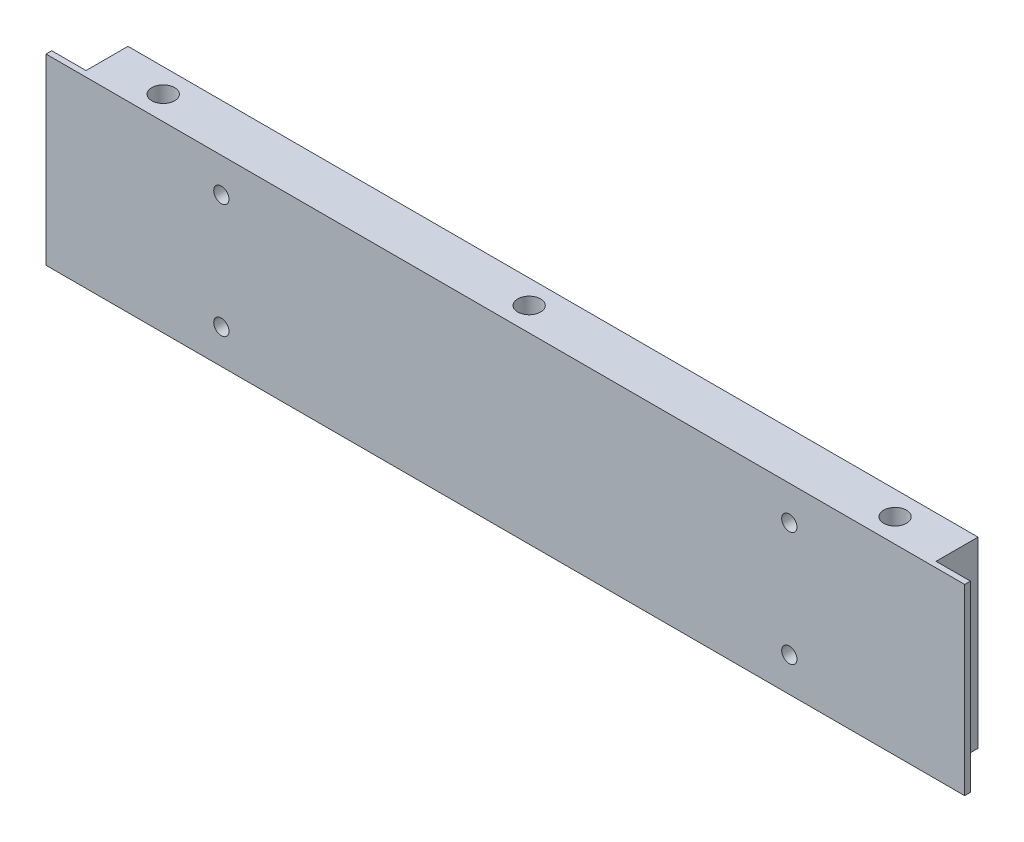
ISO-10303-21;
HEADER;
FILE_DESCRIPTION(('STEP AP214'),'2;1');
FILE_NAME('part.step','',(''),(''),'','','');
FILE_SCHEMA(('AUTOMOTIVE_DESIGN { 1 0 10303 214 1 1 1 1 }'));
ENDSEC;
DATA;
#1=APPLICATION_CONTEXT('core data for automotive mechanical design processes');
#2=APPLICATION_PROTOCOL_DEFINITION('international standard','automotive_design',2000,#1);
#3=PRODUCT_CONTEXT('',#1,'mechanical');
#4=PRODUCT('Part','Part','',(#3));
#5=PRODUCT_RELATED_PRODUCT_CATEGORY('part','',(#4));
#6=PRODUCT_DEFINITION_FORMATION('','',#4);
#7=PRODUCT_DEFINITION_CONTEXT('part definition',#1,'design');
#8=PRODUCT_DEFINITION('design','',#6,#7);
#9=PRODUCT_DEFINITION_SHAPE('','',#8);
#10=(LENGTH_UNIT() NAMED_UNIT(*) SI_UNIT(.MILLI.,.METRE.));
#11=(NAMED_UNIT(*) PLANE_ANGLE_UNIT() SI_UNIT($,.RADIAN.));
#12=(NAMED_UNIT(*) SI_UNIT($,.STERADIAN.) SOLID_ANGLE_UNIT());
#13=UNCERTAINTY_MEASURE_WITH_UNIT(LENGTH_MEASURE(1.E-05),#10,'distance_accuracy_value','');
#14=(GEOMETRIC_REPRESENTATION_CONTEXT(3) GLOBAL_UNCERTAINTY_ASSIGNED_CONTEXT((#13)) GLOBAL_UNIT_ASSIGNED_CONTEXT((#10,
#11,#12)) REPRESENTATION_CONTEXT('',''));
#15=CARTESIAN_POINT('',(0.,0.,0.));
#16=DIRECTION('',(0.,0.,1.));
#17=DIRECTION('',(1.,0.,0.));
#18=AXIS2_PLACEMENT_3D('',#15,#16,#17);
#19=CARTESIAN_POINT('',(0.,-48.,12.5));
#20=DIRECTION('',(0.,0.,1.));
#21=DIRECTION('',(1.,0.,0.));
#22=AXIS2_PLACEMENT_3D('',#19,#20,#21);
#23=PLANE('',#22);
#24=CARTESIAN_POINT('',(46.,-8.99999999999999,12.5));
#25=DIRECTION('',(0.,0.,1.));
#26=DIRECTION('',(1.,0.,0.));
#27=AXIS2_PLACEMENT_3D('',#24,#25,#26);
#28=CIRCLE('',#27,2.);
#29=CARTESIAN_POINT('',(48.,-8.99999999999999,12.5));
#30=VERTEX_POINT('',#29);
#31=EDGE_CURVE('E172',#30,#30,#28,.T.);
#32=ORIENTED_EDGE('',*,*,#31,.F.);
#33=EDGE_LOOP('',(#32));
#34=FACE_BOUND('',#33,.T.);
#35=CARTESIAN_POINT('',(195.,-39.,12.5));
#36=DIRECTION('',(0.,0.,1.));
#37=DIRECTION('',(-1.,0.,0.));
#38=AXIS2_PLACEMENT_3D('',#35,#36,#37);
#39=CIRCLE('',#38,2.00000000000002);
#40=CARTESIAN_POINT('',(193.,-39.,12.5));
#41=VERTEX_POINT('',#40);
#42=EDGE_CURVE('E121',#41,#41,#39,.T.);
#43=ORIENTED_EDGE('',*,*,#42,.F.);
#44=EDGE_LOOP('',(#43));
#45=FACE_BOUND('',#44,.T.);
#46=DIRECTION('',(0.,-1.,0.));
#47=VECTOR('',#46,1.);
#48=CARTESIAN_POINT('',(0.,0.,12.5));
#49=LINE('',#48,#47);
#50=CARTESIAN_POINT('',(0.,0.,12.5));
#51=VERTEX_POINT('',#50);
#52=CARTESIAN_POINT('',(0.,-48.,12.5));
#53=VERTEX_POINT('',#52);
#54=EDGE_CURVE('E123',#51,#53,#49,.T.);
#55=ORIENTED_EDGE('',*,*,#54,.T.);
#56=DIRECTION('',(1.,0.,0.));
#57=VECTOR('',#56,1.);
#58=CARTESIAN_POINT('',(0.,-48.,12.5));
#59=LINE('',#58,#57);
#60=CARTESIAN_POINT('',(241.,-48.,12.5));
#61=VERTEX_POINT('',#60);
#62=EDGE_CURVE('E147',#53,#61,#59,.T.);
#63=ORIENTED_EDGE('',*,*,#62,.T.);
#64=DIRECTION('',(0.,1.,0.));
#65=VECTOR('',#64,1.);
#66=CARTESIAN_POINT('',(241.,0.,12.5));
#67=LINE('',#66,#65);
#68=CARTESIAN_POINT('',(241.,0.,12.5));
#69=VERTEX_POINT('',#68);
#70=EDGE_CURVE('E145',#61,#69,#67,.T.);
#71=ORIENTED_EDGE('',*,*,#70,.T.);
#72=DIRECTION('',(-1.,0.,0.));
#73=VECTOR('',#72,1.);
#74=CARTESIAN_POINT('',(0.,0.,12.5));
#75=LINE('',#74,#73);
#76=EDGE_CURVE('E129',#69,#51,#75,.T.);
#77=ORIENTED_EDGE('',*,*,#76,.T.);
#78=EDGE_LOOP('',(#55,#63,#71,#77));
#79=FACE_BOUND('',#78,.T.);
#80=CARTESIAN_POINT('',(195.,-8.99999999999999,12.5));
#81=DIRECTION('',(0.,0.,1.));
#82=DIRECTION('',(-1.,0.,0.));
#83=AXIS2_PLACEMENT_3D('',#80,#81,#82);
#84=CIRCLE('',#83,2.00000000000002);
#85=CARTESIAN_POINT('',(193.,-8.99999999999999,12.5));
#86=VERTEX_POINT('',#85);
#87=EDGE_CURVE('E178',#86,#86,#84,.T.);
#88=ORIENTED_EDGE('',*,*,#87,.F.);
#89=EDGE_LOOP('',(#88));
#90=FACE_BOUND('',#89,.T.);
#91=CARTESIAN_POINT('',(46.,-39.,12.5));
#92=DIRECTION('',(0.,0.,1.));
#93=DIRECTION('',(1.,0.,0.));
#94=AXIS2_PLACEMENT_3D('',#91,#92,#93);
#95=CIRCLE('',#94,2.);
#96=CARTESIAN_POINT('',(48.,-39.,12.5));
#97=VERTEX_POINT('',#96);
#98=EDGE_CURVE('E166',#97,#97,#95,.T.);
#99=ORIENTED_EDGE('',*,*,#98,.F.);
#100=EDGE_LOOP('',(#99));
#101=FACE_BOUND('',#100,.T.);
#102=ADVANCED_FACE('F31',(#34,#45,#79,#90,#101),#23,.T.);
#103=CARTESIAN_POINT('',(0.,-48.,0.));
#104=DIRECTION('',(0.,0.,1.));
#105=DIRECTION('',(1.,0.,0.));
#106=AXIS2_PLACEMENT_3D('',#103,#104,#105);
#107=PLANE('',#106);
#108=CARTESIAN_POINT('',(46.,-8.99999999999999,0.));
#109=DIRECTION('',(0.,0.,1.));
#110=DIRECTION('',(1.,0.,0.));
#111=AXIS2_PLACEMENT_3D('',#108,#109,#110);
#112=CIRCLE('',#111,2.);
#113=CARTESIAN_POINT('',(48.,-8.99999999999999,0.));
#114=VERTEX_POINT('',#113);
#115=EDGE_CURVE('E169',#114,#114,#112,.T.);
#116=ORIENTED_EDGE('',*,*,#115,.T.);
#117=EDGE_LOOP('',(#116));
#118=FACE_BOUND('',#117,.T.);
#119=CARTESIAN_POINT('',(195.,-39.,0.));
#120=DIRECTION('',(0.,0.,1.));
#121=DIRECTION('',(-1.,0.,0.));
#122=AXIS2_PLACEMENT_3D('',#119,#120,#121);
#123=CIRCLE('',#122,2.00000000000002);
#124=CARTESIAN_POINT('',(193.,-39.,0.));
#125=VERTEX_POINT('',#124);
#126=EDGE_CURVE('E126',#125,#125,#123,.T.);
#127=ORIENTED_EDGE('',*,*,#126,.T.);
#128=EDGE_LOOP('',(#127));
#129=FACE_BOUND('',#128,.T.);
#130=DIRECTION('',(1.,0.,0.));
#131=VECTOR('',#130,1.);
#132=CARTESIAN_POINT('',(0.,-48.,0.));
#133=LINE('',#132,#131);
#134=CARTESIAN_POINT('',(9.00000000000001,-48.,0.));
#135=VERTEX_POINT('',#134);
#136=CARTESIAN_POINT('',(232.,-48.,0.));
#137=VERTEX_POINT('',#136);
#138=EDGE_CURVE('E115',#135,#137,#133,.T.);
#139=ORIENTED_EDGE('',*,*,#138,.F.);
#140=DIRECTION('',(0.,1.,0.));
#141=VECTOR('',#140,1.);
#142=CARTESIAN_POINT('',(9.00000000000001,-48.,0.));
#143=LINE('',#142,#141);
#144=CARTESIAN_POINT('',(9.00000000000001,0.,0.));
#145=VERTEX_POINT('',#144);
#146=EDGE_CURVE('E99',#135,#145,#143,.T.);
#147=ORIENTED_EDGE('',*,*,#146,.T.);
#148=DIRECTION('',(-1.,0.,0.));
#149=VECTOR('',#148,1.);
#150=CARTESIAN_POINT('',(0.,0.,0.));
#151=LINE('',#150,#149);
#152=CARTESIAN_POINT('',(232.,0.,0.));
#153=VERTEX_POINT('',#152);
#154=EDGE_CURVE('E120',#153,#145,#151,.T.);
#155=ORIENTED_EDGE('',*,*,#154,.F.);
#156=DIRECTION('',(0.,1.,0.));
#157=VECTOR('',#156,1.);
#158=CARTESIAN_POINT('',(232.,-48.,0.));
#159=LINE('',#158,#157);
#160=EDGE_CURVE('E54',#137,#153,#159,.T.);
#161=ORIENTED_EDGE('',*,*,#160,.F.);
#162=EDGE_LOOP('',(#139,#147,#155,#161));
#163=FACE_BOUND('',#162,.T.);
#164=CARTESIAN_POINT('',(195.,-8.99999999999999,0.));
#165=DIRECTION('',(0.,0.,1.));
#166=DIRECTION('',(-1.,0.,0.));
#167=AXIS2_PLACEMENT_3D('',#164,#165,#166);
#168=CIRCLE('',#167,2.00000000000002);
#169=CARTESIAN_POINT('',(193.,-8.99999999999999,0.));
#170=VERTEX_POINT('',#169);
#171=EDGE_CURVE('E175',#170,#170,#168,.T.);
#172=ORIENTED_EDGE('',*,*,#171,.T.);
#173=EDGE_LOOP('',(#172));
#174=FACE_BOUND('',#173,.T.);
#175=CARTESIAN_POINT('',(46.,-39.,0.));
#176=DIRECTION('',(0.,0.,1.));
#177=DIRECTION('',(1.,0.,0.));
#178=AXIS2_PLACEMENT_3D('',#175,#176,#177);
#179=CIRCLE('',#178,2.);
#180=CARTESIAN_POINT('',(48.,-39.,0.));
#181=VERTEX_POINT('',#180);
#182=EDGE_CURVE('E164',#181,#181,#179,.T.);
#183=ORIENTED_EDGE('',*,*,#182,.T.);
#184=EDGE_LOOP('',(#183));
#185=FACE_BOUND('',#184,.T.);
#186=ADVANCED_FACE('F118',(#118,#129,#163,#174,#185),#107,.F.);
#187=CARTESIAN_POINT('',(0.,0.,12.5));
#188=DIRECTION('',(1.,0.,0.));
#189=DIRECTION('',(0.,1.,0.));
#190=AXIS2_PLACEMENT_3D('',#187,#188,#189);
#191=PLANE('',#190);
#192=DIRECTION('',(0.,0.,-1.));
#193=VECTOR('',#192,1.);
#194=CARTESIAN_POINT('',(0.,0.,12.5));
#195=LINE('',#194,#193);
#196=CARTESIAN_POINT('',(0.,0.,11.));
#197=VERTEX_POINT('',#196);
#198=EDGE_CURVE('E132',#51,#197,#195,.T.);
#199=ORIENTED_EDGE('',*,*,#198,.T.);
#200=DIRECTION('',(0.,1.,0.));
#201=VECTOR('',#200,1.);
#202=CARTESIAN_POINT('',(0.,-48.,11.));
#203=LINE('',#202,#201);
#204=CARTESIAN_POINT('',(0.,-48.,11.));
#205=VERTEX_POINT('',#204);
#206=EDGE_CURVE('E46',#205,#197,#203,.T.);
#207=ORIENTED_EDGE('',*,*,#206,.F.);
#208=DIRECTION('',(0.,0.,-1.));
#209=VECTOR('',#208,1.);
#210=CARTESIAN_POINT('',(0.,-48.,12.5));
#211=LINE('',#210,#209);
#212=EDGE_CURVE('E11',#53,#205,#211,.T.);
#213=ORIENTED_EDGE('',*,*,#212,.F.);
#214=ORIENTED_EDGE('',*,*,#54,.F.);
#215=EDGE_LOOP('',(#199,#207,#213,#214));
#216=FACE_BOUND('',#215,.T.);
#217=ADVANCED_FACE('F33',(#216),#191,.F.);
#218=CARTESIAN_POINT('',(0.,-48.,12.5));
#219=DIRECTION('',(0.,1.,0.));
#220=DIRECTION('',(-1.,0.,0.));
#221=AXIS2_PLACEMENT_3D('',#218,#219,#220);
#222=PLANE('',#221);
#223=CARTESIAN_POINT('',(216.5,-48.,6.25000000000003));
#224=DIRECTION('',(0.,1.,0.));
#225=DIRECTION('',(-1.,0.,0.));
#226=AXIS2_PLACEMENT_3D('',#223,#224,#225);
#227=CIRCLE('',#226,3.00000000000002);
#228=CARTESIAN_POINT('',(213.5,-48.,6.25000000000003));
#229=VERTEX_POINT('',#228);
#230=EDGE_CURVE('E213',#229,#229,#227,.F.);
#231=ORIENTED_EDGE('',*,*,#230,.F.);
#232=EDGE_LOOP('',(#231));
#233=FACE_BOUND('',#232,.T.);
#234=CARTESIAN_POINT('',(24.5,-48.,6.25000000000003));
#235=DIRECTION('',(0.,1.,0.));
#236=DIRECTION('',(-1.,0.,0.));
#237=AXIS2_PLACEMENT_3D('',#234,#235,#236);
#238=CIRCLE('',#237,3.);
#239=CARTESIAN_POINT('',(21.5,-48.,6.25000000000003));
#240=VERTEX_POINT('',#239);
#241=EDGE_CURVE('E207',#240,#240,#238,.F.);
#242=ORIENTED_EDGE('',*,*,#241,.F.);
#243=EDGE_LOOP('',(#242));
#244=FACE_BOUND('',#243,.T.);
#245=CARTESIAN_POINT('',(120.5,-48.,6.25000000000003));
#246=DIRECTION('',(0.,1.,0.));
#247=DIRECTION('',(-1.,0.,0.));
#248=AXIS2_PLACEMENT_3D('',#245,#246,#247);
#249=CIRCLE('',#248,3.00000000000001);
#250=CARTESIAN_POINT('',(117.5,-48.,6.25000000000003));
#251=VERTEX_POINT('',#250);
#252=EDGE_CURVE('E200',#251,#251,#249,.F.);
#253=ORIENTED_EDGE('',*,*,#252,.F.);
#254=EDGE_LOOP('',(#253));
#255=FACE_BOUND('',#254,.T.);
#256=DIRECTION('',(1.,0.,0.));
#257=VECTOR('',#256,1.);
#258=CARTESIAN_POINT('',(9.,-48.,11.));
#259=LINE('',#258,#257);
#260=CARTESIAN_POINT('',(9.,-48.,11.));
#261=VERTEX_POINT('',#260);
#262=EDGE_CURVE('E110',#205,#261,#259,.T.);
#263=ORIENTED_EDGE('',*,*,#262,.T.);
#264=DIRECTION('',(0.,0.,-1.));
#265=VECTOR('',#264,1.);
#266=CARTESIAN_POINT('',(9.00000000000001,-48.,0.));
#267=LINE('',#266,#265);
#268=EDGE_CURVE('E102',#261,#135,#267,.T.);
#269=ORIENTED_EDGE('',*,*,#268,.T.);
#270=ORIENTED_EDGE('',*,*,#138,.T.);
#271=DIRECTION('',(0.,0.,1.));
#272=VECTOR('',#271,1.);
#273=CARTESIAN_POINT('',(232.,-48.,0.));
#274=LINE('',#273,#272);
#275=CARTESIAN_POINT('',(232.,-48.,11.));
#276=VERTEX_POINT('',#275);
#277=EDGE_CURVE('E151',#137,#276,#274,.T.);
#278=ORIENTED_EDGE('',*,*,#277,.T.);
#279=DIRECTION('',(1.,0.,0.));
#280=VECTOR('',#279,1.);
#281=CARTESIAN_POINT('',(232.,-48.,11.));
#282=LINE('',#281,#280);
#283=CARTESIAN_POINT('',(241.,-48.,11.));
#284=VERTEX_POINT('',#283);
#285=EDGE_CURVE('E150',#276,#284,#282,.T.);
#286=ORIENTED_EDGE('',*,*,#285,.T.);
#287=DIRECTION('',(0.,0.,-1.));
#288=VECTOR('',#287,1.);
#289=CARTESIAN_POINT('',(241.,-48.,12.5));
#290=LINE('',#289,#288);
#291=EDGE_CURVE('E39',#61,#284,#290,.T.);
#292=ORIENTED_EDGE('',*,*,#291,.F.);
#293=ORIENTED_EDGE('',*,*,#62,.F.);
#294=ORIENTED_EDGE('',*,*,#212,.T.);
#295=EDGE_LOOP('',(#263,#269,#270,#278,#286,#292,#293,#294));
#296=FACE_BOUND('',#295,.T.);
#297=ADVANCED_FACE('F113',(#233,#244,#255,#296),#222,.F.);
#298=CARTESIAN_POINT('',(241.,0.,12.5));
#299=DIRECTION('',(-1.,0.,0.));
#300=DIRECTION('',(0.,0.,1.));
#301=AXIS2_PLACEMENT_3D('',#298,#299,#300);
#302=PLANE('',#301);
#303=ORIENTED_EDGE('',*,*,#291,.T.);
#304=DIRECTION('',(0.,1.,0.));
#305=VECTOR('',#304,1.);
#306=CARTESIAN_POINT('',(241.,-48.,11.));
#307=LINE('',#306,#305);
#308=CARTESIAN_POINT('',(241.,0.,11.));
#309=VERTEX_POINT('',#308);
#310=EDGE_CURVE('E144',#284,#309,#307,.T.);
#311=ORIENTED_EDGE('',*,*,#310,.T.);
#312=DIRECTION('',(0.,0.,-1.));
#313=VECTOR('',#312,1.);
#314=CARTESIAN_POINT('',(241.,0.,12.5));
#315=LINE('',#314,#313);
#316=EDGE_CURVE('E135',#69,#309,#315,.T.);
#317=ORIENTED_EDGE('',*,*,#316,.F.);
#318=ORIENTED_EDGE('',*,*,#70,.F.);
#319=EDGE_LOOP('',(#303,#311,#317,#318));
#320=FACE_BOUND('',#319,.T.);
#321=ADVANCED_FACE('F142',(#320),#302,.F.);
#322=CARTESIAN_POINT('',(0.,0.,12.5));
#323=DIRECTION('',(0.,-1.,0.));
#324=DIRECTION('',(1.,0.,0.));
#325=AXIS2_PLACEMENT_3D('',#322,#323,#324);
#326=PLANE('',#325);
#327=CARTESIAN_POINT('',(216.5,0.,6.25000000000003));
#328=DIRECTION('',(0.,1.,0.));
#329=DIRECTION('',(1.,0.,0.));
#330=AXIS2_PLACEMENT_3D('',#327,#328,#329);
#331=CIRCLE('',#330,3.00000000000002);
#332=CARTESIAN_POINT('',(219.5,0.,6.25000000000003));
#333=VERTEX_POINT('',#332);
#334=EDGE_CURVE('E216',#333,#333,#331,.T.);
#335=ORIENTED_EDGE('',*,*,#334,.F.);
#336=EDGE_LOOP('',(#335));
#337=FACE_BOUND('',#336,.T.);
#338=CARTESIAN_POINT('',(24.5,0.,6.25000000000003));
#339=DIRECTION('',(0.,1.,0.));
#340=DIRECTION('',(-1.,0.,0.));
#341=AXIS2_PLACEMENT_3D('',#338,#339,#340);
#342=CIRCLE('',#341,3.);
#343=CARTESIAN_POINT('',(21.5,0.,6.25000000000003));
#344=VERTEX_POINT('',#343);
#345=EDGE_CURVE('E210',#344,#344,#342,.T.);
#346=ORIENTED_EDGE('',*,*,#345,.F.);
#347=EDGE_LOOP('',(#346));
#348=FACE_BOUND('',#347,.T.);
#349=CARTESIAN_POINT('',(120.5,0.,6.25000000000003));
#350=DIRECTION('',(0.,1.,0.));
#351=DIRECTION('',(-1.,0.,0.));
#352=AXIS2_PLACEMENT_3D('',#349,#350,#351);
#353=CIRCLE('',#352,3.00000000000001);
#354=CARTESIAN_POINT('',(117.5,0.,6.25000000000003));
#355=VERTEX_POINT('',#354);
#356=EDGE_CURVE('E204',#355,#355,#353,.T.);
#357=ORIENTED_EDGE('',*,*,#356,.F.);
#358=EDGE_LOOP('',(#357));
#359=FACE_BOUND('',#358,.T.);
#360=ORIENTED_EDGE('',*,*,#154,.T.);
#361=DIRECTION('',(0.,0.,-1.));
#362=VECTOR('',#361,1.);
#363=CARTESIAN_POINT('',(9.00000000000001,0.,0.));
#364=LINE('',#363,#362);
#365=CARTESIAN_POINT('',(9.,0.,11.));
#366=VERTEX_POINT('',#365);
#367=EDGE_CURVE('E105',#366,#145,#364,.T.);
#368=ORIENTED_EDGE('',*,*,#367,.F.);
#369=DIRECTION('',(1.,0.,0.));
#370=VECTOR('',#369,1.);
#371=CARTESIAN_POINT('',(9.,0.,11.));
#372=LINE('',#371,#370);
#373=EDGE_CURVE('E116',#197,#366,#372,.T.);
#374=ORIENTED_EDGE('',*,*,#373,.F.);
#375=ORIENTED_EDGE('',*,*,#198,.F.);
#376=ORIENTED_EDGE('',*,*,#76,.F.);
#377=ORIENTED_EDGE('',*,*,#316,.T.);
#378=DIRECTION('',(1.,0.,0.));
#379=VECTOR('',#378,1.);
#380=CARTESIAN_POINT('',(232.,0.,11.));
#381=LINE('',#380,#379);
#382=CARTESIAN_POINT('',(232.,0.,11.));
#383=VERTEX_POINT('',#382);
#384=EDGE_CURVE('E156',#383,#309,#381,.T.);
#385=ORIENTED_EDGE('',*,*,#384,.F.);
#386=DIRECTION('',(0.,0.,1.));
#387=VECTOR('',#386,1.);
#388=CARTESIAN_POINT('',(232.,0.,0.));
#389=LINE('',#388,#387);
#390=EDGE_CURVE('E159',#153,#383,#389,.T.);
#391=ORIENTED_EDGE('',*,*,#390,.F.);
#392=EDGE_LOOP('',(#360,#368,#374,#375,#376,#377,#385,#391));
#393=FACE_BOUND('',#392,.T.);
#394=ADVANCED_FACE('F193',(#337,#348,#359,#393),#326,.F.);
#395=CARTESIAN_POINT('',(195.,-39.,12.5));
#396=DIRECTION('',(0.,0.,-1.));
#397=DIRECTION('',(-1.,0.,0.));
#398=AXIS2_PLACEMENT_3D('',#395,#396,#397);
#399=CYLINDRICAL_SURFACE('',#398,2.00000000000002);
#400=ORIENTED_EDGE('',*,*,#42,.T.);
#401=EDGE_LOOP('',(#400));
#402=FACE_BOUND('',#401,.T.);
#403=ORIENTED_EDGE('',*,*,#126,.F.);
#404=EDGE_LOOP('',(#403));
#405=FACE_BOUND('',#404,.T.);
#406=ADVANCED_FACE('F225',(#402,#405),#399,.F.);
#407=CARTESIAN_POINT('',(195.,-8.99999999999999,12.5));
#408=DIRECTION('',(0.,0.,-1.));
#409=DIRECTION('',(-1.,0.,0.));
#410=AXIS2_PLACEMENT_3D('',#407,#408,#409);
#411=CYLINDRICAL_SURFACE('',#410,2.00000000000002);
#412=ORIENTED_EDGE('',*,*,#87,.T.);
#413=EDGE_LOOP('',(#412));
#414=FACE_BOUND('',#413,.T.);
#415=ORIENTED_EDGE('',*,*,#171,.F.);
#416=EDGE_LOOP('',(#415));
#417=FACE_BOUND('',#416,.T.);
#418=ADVANCED_FACE('F261',(#414,#417),#411,.F.);
#419=CARTESIAN_POINT('',(46.,-8.99999999999999,12.5));
#420=DIRECTION('',(0.,0.,-1.));
#421=DIRECTION('',(-1.,0.,0.));
#422=AXIS2_PLACEMENT_3D('',#419,#420,#421);
#423=CYLINDRICAL_SURFACE('',#422,2.);
#424=ORIENTED_EDGE('',*,*,#31,.T.);
#425=EDGE_LOOP('',(#424));
#426=FACE_BOUND('',#425,.T.);
#427=ORIENTED_EDGE('',*,*,#115,.F.);
#428=EDGE_LOOP('',(#427));
#429=FACE_BOUND('',#428,.T.);
#430=ADVANCED_FACE('F265',(#426,#429),#423,.F.);
#431=CARTESIAN_POINT('',(46.,-39.,12.5));
#432=DIRECTION('',(0.,0.,-1.));
#433=DIRECTION('',(-1.,0.,0.));
#434=AXIS2_PLACEMENT_3D('',#431,#432,#433);
#435=CYLINDRICAL_SURFACE('',#434,2.);
#436=ORIENTED_EDGE('',*,*,#98,.T.);
#437=EDGE_LOOP('',(#436));
#438=FACE_BOUND('',#437,.T.);
#439=ORIENTED_EDGE('',*,*,#182,.F.);
#440=EDGE_LOOP('',(#439));
#441=FACE_BOUND('',#440,.T.);
#442=ADVANCED_FACE('F269',(#438,#441),#435,.F.);
#443=CARTESIAN_POINT('',(232.,-48.,11.));
#444=DIRECTION('',(0.,0.,1.));
#445=DIRECTION('',(1.,0.,0.));
#446=AXIS2_PLACEMENT_3D('',#443,#444,#445);
#447=PLANE('',#446);
#448=ORIENTED_EDGE('',*,*,#384,.T.);
#449=ORIENTED_EDGE('',*,*,#310,.F.);
#450=ORIENTED_EDGE('',*,*,#285,.F.);
#451=DIRECTION('',(0.,1.,0.));
#452=VECTOR('',#451,1.);
#453=CARTESIAN_POINT('',(232.,-48.,11.));
#454=LINE('',#453,#452);
#455=EDGE_CURVE('E154',#276,#383,#454,.T.);
#456=ORIENTED_EDGE('',*,*,#455,.T.);
#457=EDGE_LOOP('',(#448,#449,#450,#456));
#458=FACE_BOUND('',#457,.T.);
#459=ADVANCED_FACE('F273',(#458),#447,.F.);
#460=CARTESIAN_POINT('',(232.,-48.,0.));
#461=DIRECTION('',(-1.,0.,0.));
#462=DIRECTION('',(0.,0.,1.));
#463=AXIS2_PLACEMENT_3D('',#460,#461,#462);
#464=PLANE('',#463);
#465=ORIENTED_EDGE('',*,*,#390,.T.);
#466=ORIENTED_EDGE('',*,*,#455,.F.);
#467=ORIENTED_EDGE('',*,*,#277,.F.);
#468=ORIENTED_EDGE('',*,*,#160,.T.);
#469=EDGE_LOOP('',(#465,#466,#467,#468));
#470=FACE_BOUND('',#469,.T.);
#471=ADVANCED_FACE('F275',(#470),#464,.F.);
#472=CARTESIAN_POINT('',(9.00000000000001,-48.,0.));
#473=DIRECTION('',(1.,0.,0.));
#474=DIRECTION('',(0.,0.,-1.));
#475=AXIS2_PLACEMENT_3D('',#472,#473,#474);
#476=PLANE('',#475);
#477=ORIENTED_EDGE('',*,*,#367,.T.);
#478=ORIENTED_EDGE('',*,*,#146,.F.);
#479=ORIENTED_EDGE('',*,*,#268,.F.);
#480=DIRECTION('',(0.,1.,0.));
#481=VECTOR('',#480,1.);
#482=CARTESIAN_POINT('',(9.,-48.,11.));
#483=LINE('',#482,#481);
#484=EDGE_CURVE('E161',#261,#366,#483,.T.);
#485=ORIENTED_EDGE('',*,*,#484,.T.);
#486=EDGE_LOOP('',(#477,#478,#479,#485));
#487=FACE_BOUND('',#486,.T.);
#488=ADVANCED_FACE('F101',(#487),#476,.F.);
#489=CARTESIAN_POINT('',(9.,-48.,11.));
#490=DIRECTION('',(0.,0.,1.));
#491=DIRECTION('',(1.,0.,0.));
#492=AXIS2_PLACEMENT_3D('',#489,#490,#491);
#493=PLANE('',#492);
#494=ORIENTED_EDGE('',*,*,#373,.T.);
#495=ORIENTED_EDGE('',*,*,#484,.F.);
#496=ORIENTED_EDGE('',*,*,#262,.F.);
#497=ORIENTED_EDGE('',*,*,#206,.T.);
#498=EDGE_LOOP('',(#494,#495,#496,#497));
#499=FACE_BOUND('',#498,.T.);
#500=ADVANCED_FACE('F235',(#499),#493,.F.);
#501=CARTESIAN_POINT('',(120.5,-48.001,6.25000000000003));
#502=DIRECTION('',(0.,1.,0.));
#503=DIRECTION('',(-1.,0.,0.));
#504=AXIS2_PLACEMENT_3D('',#501,#502,#503);
#505=CYLINDRICAL_SURFACE('',#504,3.00000000000001);
#506=ORIENTED_EDGE('',*,*,#356,.T.);
#507=EDGE_LOOP('',(#506));
#508=FACE_BOUND('',#507,.T.);
#509=ORIENTED_EDGE('',*,*,#252,.T.);
#510=EDGE_LOOP('',(#509));
#511=FACE_BOUND('',#510,.T.);
#512=ADVANCED_FACE('F231',(#508,#511),#505,.F.);
#513=CARTESIAN_POINT('',(24.5,-48.001,6.25000000000003));
#514=DIRECTION('',(0.,1.,0.));
#515=DIRECTION('',(-1.,0.,0.));
#516=AXIS2_PLACEMENT_3D('',#513,#514,#515);
#517=CYLINDRICAL_SURFACE('',#516,3.);
#518=ORIENTED_EDGE('',*,*,#345,.T.);
#519=EDGE_LOOP('',(#518));
#520=FACE_BOUND('',#519,.T.);
#521=ORIENTED_EDGE('',*,*,#241,.T.);
#522=EDGE_LOOP('',(#521));
#523=FACE_BOUND('',#522,.T.);
#524=ADVANCED_FACE('F234',(#520,#523),#517,.F.);
#525=CARTESIAN_POINT('',(216.5,-48.001,6.25000000000003));
#526=DIRECTION('',(0.,1.,0.));
#527=DIRECTION('',(-1.,0.,0.));
#528=AXIS2_PLACEMENT_3D('',#525,#526,#527);
#529=CYLINDRICAL_SURFACE('',#528,3.00000000000002);
#530=ORIENTED_EDGE('',*,*,#334,.T.);
#531=EDGE_LOOP('',(#530));
#532=FACE_BOUND('',#531,.T.);
#533=ORIENTED_EDGE('',*,*,#230,.T.);
#534=EDGE_LOOP('',(#533));
#535=FACE_BOUND('',#534,.T.);
#536=ADVANCED_FACE('F220',(#532,#535),#529,.F.);
#537=CLOSED_SHELL('',(#102,#186,#217,#297,#321,#394,#406,#418,#430,#442,#459,#471,#488,#500,
#512,#524,#536));
#538=MANIFOLD_SOLID_BREP('B2',#537);
#539=ADVANCED_BREP_SHAPE_REPRESENTATION('',(#18,#538),#14);
#540=SHAPE_DEFINITION_REPRESENTATION(#9,#539);
ENDSEC;
END-ISO-10303-21;
